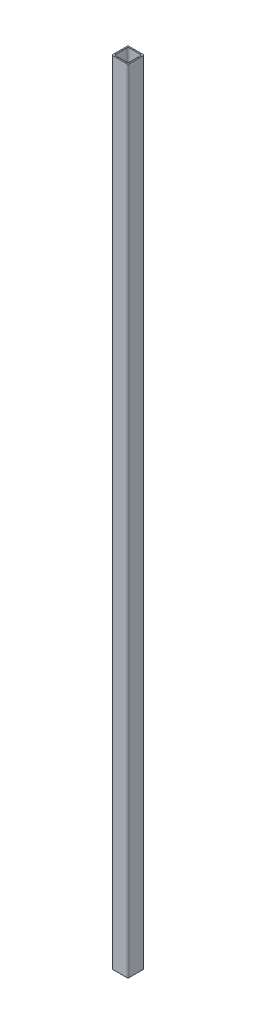
ISO-10303-21;
HEADER;
FILE_DESCRIPTION(('STEP AP214'),'2;1');
FILE_NAME('part.step','',(''),(''),'','','');
FILE_SCHEMA(('AUTOMOTIVE_DESIGN { 1 0 10303 214 1 1 1 1 }'));
ENDSEC;
DATA;
#1=APPLICATION_CONTEXT('core data for automotive mechanical design processes');
#2=APPLICATION_PROTOCOL_DEFINITION('international standard','automotive_design',2000,#1);
#3=PRODUCT_CONTEXT('',#1,'mechanical');
#4=PRODUCT('Part','Part','',(#3));
#5=PRODUCT_RELATED_PRODUCT_CATEGORY('part','',(#4));
#6=PRODUCT_DEFINITION_FORMATION('','',#4);
#7=PRODUCT_DEFINITION_CONTEXT('part definition',#1,'design');
#8=PRODUCT_DEFINITION('design','',#6,#7);
#9=PRODUCT_DEFINITION_SHAPE('','',#8);
#10=(LENGTH_UNIT() NAMED_UNIT(*) SI_UNIT(.MILLI.,.METRE.));
#11=(NAMED_UNIT(*) PLANE_ANGLE_UNIT() SI_UNIT($,.RADIAN.));
#12=(NAMED_UNIT(*) SI_UNIT($,.STERADIAN.) SOLID_ANGLE_UNIT());
#13=UNCERTAINTY_MEASURE_WITH_UNIT(LENGTH_MEASURE(1.E-05),#10,'distance_accuracy_value','');
#14=(GEOMETRIC_REPRESENTATION_CONTEXT(3) GLOBAL_UNCERTAINTY_ASSIGNED_CONTEXT((#13)) GLOBAL_UNIT_ASSIGNED_CONTEXT((#10,
#11,#12)) REPRESENTATION_CONTEXT('',''));
#15=CARTESIAN_POINT('',(0.,0.,0.));
#16=DIRECTION('',(0.,0.,1.));
#17=DIRECTION('',(1.,0.,0.));
#18=AXIS2_PLACEMENT_3D('',#15,#16,#17);
#19=CARTESIAN_POINT('',(-9.,1200.,9.));
#20=DIRECTION('',(0.,-1.,0.));
#21=DIRECTION('',(0.,0.,-1.));
#22=AXIS2_PLACEMENT_3D('',#19,#20,#21);
#23=CYLINDRICAL_SURFACE('',#22,0.999999999999999);
#24=CARTESIAN_POINT('',(-9.,220.,9.));
#25=DIRECTION('',(0.,-1.,0.));
#26=DIRECTION('',(0.,0.,-1.));
#27=AXIS2_PLACEMENT_3D('',#24,#25,#26);
#28=CIRCLE('',#27,0.999999999999999);
#29=CARTESIAN_POINT('',(-8.99999999999999,220.,10.));
#30=VERTEX_POINT('',#29);
#31=CARTESIAN_POINT('',(-10.,220.,8.99999999999999));
#32=VERTEX_POINT('',#31);
#33=EDGE_CURVE('E55',#30,#32,#28,.T.);
#34=ORIENTED_EDGE('',*,*,#33,.F.);
#35=DIRECTION('',(0.,-1.,0.));
#36=VECTOR('',#35,1.);
#37=CARTESIAN_POINT('',(-8.99999999999999,1200.,10.));
#38=LINE('',#37,#36);
#39=CARTESIAN_POINT('',(-8.99999999999999,1200.,10.));
#40=VERTEX_POINT('',#39);
#41=EDGE_CURVE('E48',#40,#30,#38,.T.);
#42=ORIENTED_EDGE('',*,*,#41,.F.);
#43=CARTESIAN_POINT('',(-9.,1200.,9.));
#44=DIRECTION('',(0.,1.,0.));
#45=DIRECTION('',(0.,0.,-1.));
#46=AXIS2_PLACEMENT_3D('',#43,#44,#45);
#47=CIRCLE('',#46,0.999999999999999);
#48=CARTESIAN_POINT('',(-10.,1200.,8.99999999999999));
#49=VERTEX_POINT('',#48);
#50=EDGE_CURVE('E203',#49,#40,#47,.T.);
#51=ORIENTED_EDGE('',*,*,#50,.F.);
#52=DIRECTION('',(0.,-1.,0.));
#53=VECTOR('',#52,1.);
#54=CARTESIAN_POINT('',(-10.,1200.,8.99999999999999));
#55=LINE('',#54,#53);
#56=EDGE_CURVE('E228',#49,#32,#55,.T.);
#57=ORIENTED_EDGE('',*,*,#56,.T.);
#58=EDGE_LOOP('',(#34,#42,#51,#57));
#59=FACE_BOUND('',#58,.T.);
#60=ADVANCED_FACE('F40',(#59),#23,.T.);
#61=CARTESIAN_POINT('',(-8.99999999999999,1200.,10.));
#62=DIRECTION('',(0.,0.,-1.));
#63=DIRECTION('',(-1.,0.,0.));
#64=AXIS2_PLACEMENT_3D('',#61,#62,#63);
#65=PLANE('',#64);
#66=DIRECTION('',(-1.,0.,0.));
#67=VECTOR('',#66,1.);
#68=CARTESIAN_POINT('',(-8.99999999999999,220.,10.));
#69=LINE('',#68,#67);
#70=CARTESIAN_POINT('',(8.99999999999999,220.,10.));
#71=VERTEX_POINT('',#70);
#72=EDGE_CURVE('E262',#71,#30,#69,.T.);
#73=ORIENTED_EDGE('',*,*,#72,.F.);
#74=DIRECTION('',(0.,-1.,0.));
#75=VECTOR('',#74,1.);
#76=CARTESIAN_POINT('',(8.99999999999999,1200.,10.));
#77=LINE('',#76,#75);
#78=CARTESIAN_POINT('',(8.99999999999999,1200.,10.));
#79=VERTEX_POINT('',#78);
#80=EDGE_CURVE('E252',#79,#71,#77,.T.);
#81=ORIENTED_EDGE('',*,*,#80,.F.);
#82=DIRECTION('',(1.,0.,0.));
#83=VECTOR('',#82,1.);
#84=CARTESIAN_POINT('',(-8.99999999999999,1200.,10.));
#85=LINE('',#84,#83);
#86=EDGE_CURVE('E207',#40,#79,#85,.T.);
#87=ORIENTED_EDGE('',*,*,#86,.F.);
#88=ORIENTED_EDGE('',*,*,#41,.T.);
#89=EDGE_LOOP('',(#73,#81,#87,#88));
#90=FACE_BOUND('',#89,.T.);
#91=ADVANCED_FACE('F260',(#90),#65,.F.);
#92=CARTESIAN_POINT('',(9.,1200.,9.));
#93=DIRECTION('',(0.,-1.,0.));
#94=DIRECTION('',(0.,0.,-1.));
#95=AXIS2_PLACEMENT_3D('',#92,#93,#94);
#96=CYLINDRICAL_SURFACE('',#95,0.999999999999999);
#97=CARTESIAN_POINT('',(9.,220.,9.));
#98=DIRECTION('',(0.,-1.,0.));
#99=DIRECTION('',(0.,0.,-1.));
#100=AXIS2_PLACEMENT_3D('',#97,#98,#99);
#101=CIRCLE('',#100,0.999999999999999);
#102=CARTESIAN_POINT('',(10.,220.,8.99999999999999));
#103=VERTEX_POINT('',#102);
#104=EDGE_CURVE('E273',#103,#71,#101,.T.);
#105=ORIENTED_EDGE('',*,*,#104,.F.);
#106=DIRECTION('',(0.,-1.,0.));
#107=VECTOR('',#106,1.);
#108=CARTESIAN_POINT('',(10.,1200.,8.99999999999999));
#109=LINE('',#108,#107);
#110=CARTESIAN_POINT('',(10.,1200.,8.99999999999999));
#111=VERTEX_POINT('',#110);
#112=EDGE_CURVE('E248',#111,#103,#109,.T.);
#113=ORIENTED_EDGE('',*,*,#112,.F.);
#114=CARTESIAN_POINT('',(9.,1200.,9.));
#115=DIRECTION('',(0.,1.,0.));
#116=DIRECTION('',(0.,0.,1.));
#117=AXIS2_PLACEMENT_3D('',#114,#115,#116);
#118=CIRCLE('',#117,0.999999999999999);
#119=EDGE_CURVE('E210',#79,#111,#118,.T.);
#120=ORIENTED_EDGE('',*,*,#119,.F.);
#121=ORIENTED_EDGE('',*,*,#80,.T.);
#122=EDGE_LOOP('',(#105,#113,#120,#121));
#123=FACE_BOUND('',#122,.T.);
#124=ADVANCED_FACE('F331',(#123),#96,.T.);
#125=CARTESIAN_POINT('',(10.,1200.,8.99999999999999));
#126=DIRECTION('',(-1.,0.,0.));
#127=DIRECTION('',(0.,0.,1.));
#128=AXIS2_PLACEMENT_3D('',#125,#126,#127);
#129=PLANE('',#128);
#130=DIRECTION('',(0.,0.,1.));
#131=VECTOR('',#130,1.);
#132=CARTESIAN_POINT('',(10.,220.,8.99999999999999));
#133=LINE('',#132,#131);
#134=CARTESIAN_POINT('',(10.,220.,-8.99999999999999));
#135=VERTEX_POINT('',#134);
#136=EDGE_CURVE('E324',#135,#103,#133,.T.);
#137=ORIENTED_EDGE('',*,*,#136,.F.);
#138=DIRECTION('',(0.,-1.,0.));
#139=VECTOR('',#138,1.);
#140=CARTESIAN_POINT('',(10.,1200.,-8.99999999999999));
#141=LINE('',#140,#139);
#142=CARTESIAN_POINT('',(10.,1200.,-8.99999999999999));
#143=VERTEX_POINT('',#142);
#144=EDGE_CURVE('E244',#143,#135,#141,.T.);
#145=ORIENTED_EDGE('',*,*,#144,.F.);
#146=DIRECTION('',(0.,0.,-1.));
#147=VECTOR('',#146,1.);
#148=CARTESIAN_POINT('',(10.,1200.,8.99999999999999));
#149=LINE('',#148,#147);
#150=EDGE_CURVE('E213',#111,#143,#149,.T.);
#151=ORIENTED_EDGE('',*,*,#150,.F.);
#152=ORIENTED_EDGE('',*,*,#112,.T.);
#153=EDGE_LOOP('',(#137,#145,#151,#152));
#154=FACE_BOUND('',#153,.T.);
#155=ADVANCED_FACE('F335',(#154),#129,.F.);
#156=CARTESIAN_POINT('',(9.,1200.,-9.));
#157=DIRECTION('',(0.,-1.,0.));
#158=DIRECTION('',(0.,0.,-1.));
#159=AXIS2_PLACEMENT_3D('',#156,#157,#158);
#160=CYLINDRICAL_SURFACE('',#159,0.999999999999999);
#161=CARTESIAN_POINT('',(9.,220.,-9.));
#162=DIRECTION('',(0.,-1.,0.));
#163=DIRECTION('',(0.,0.,-1.));
#164=AXIS2_PLACEMENT_3D('',#161,#162,#163);
#165=CIRCLE('',#164,0.999999999999999);
#166=CARTESIAN_POINT('',(8.99999999999999,220.,-10.));
#167=VERTEX_POINT('',#166);
#168=EDGE_CURVE('E321',#167,#135,#165,.T.);
#169=ORIENTED_EDGE('',*,*,#168,.F.);
#170=DIRECTION('',(0.,-1.,0.));
#171=VECTOR('',#170,1.);
#172=CARTESIAN_POINT('',(8.99999999999999,1200.,-10.));
#173=LINE('',#172,#171);
#174=CARTESIAN_POINT('',(8.99999999999999,1200.,-10.));
#175=VERTEX_POINT('',#174);
#176=EDGE_CURVE('E240',#175,#167,#173,.T.);
#177=ORIENTED_EDGE('',*,*,#176,.F.);
#178=CARTESIAN_POINT('',(9.,1200.,-9.));
#179=DIRECTION('',(0.,1.,0.));
#180=DIRECTION('',(0.,0.,-1.));
#181=AXIS2_PLACEMENT_3D('',#178,#179,#180);
#182=CIRCLE('',#181,0.999999999999999);
#183=EDGE_CURVE('E216',#143,#175,#182,.T.);
#184=ORIENTED_EDGE('',*,*,#183,.F.);
#185=ORIENTED_EDGE('',*,*,#144,.T.);
#186=EDGE_LOOP('',(#169,#177,#184,#185));
#187=FACE_BOUND('',#186,.T.);
#188=ADVANCED_FACE('F355',(#187),#160,.T.);
#189=CARTESIAN_POINT('',(-8.99999999999999,1200.,-10.));
#190=DIRECTION('',(0.,0.,1.));
#191=DIRECTION('',(1.,0.,0.));
#192=AXIS2_PLACEMENT_3D('',#189,#190,#191);
#193=PLANE('',#192);
#194=DIRECTION('',(1.,0.,0.));
#195=VECTOR('',#194,1.);
#196=CARTESIAN_POINT('',(-8.99999999999999,220.,-10.));
#197=LINE('',#196,#195);
#198=CARTESIAN_POINT('',(-9.,220.,-10.));
#199=VERTEX_POINT('',#198);
#200=EDGE_CURVE('E318',#199,#167,#197,.T.);
#201=ORIENTED_EDGE('',*,*,#200,.F.);
#202=DIRECTION('',(0.,-1.,0.));
#203=VECTOR('',#202,1.);
#204=CARTESIAN_POINT('',(-8.99999999999999,1200.,-10.));
#205=LINE('',#204,#203);
#206=CARTESIAN_POINT('',(-8.99999999999999,1200.,-10.));
#207=VERTEX_POINT('',#206);
#208=EDGE_CURVE('E236',#207,#199,#205,.T.);
#209=ORIENTED_EDGE('',*,*,#208,.F.);
#210=DIRECTION('',(-1.,0.,0.));
#211=VECTOR('',#210,1.);
#212=CARTESIAN_POINT('',(-8.99999999999999,1200.,-10.));
#213=LINE('',#212,#211);
#214=EDGE_CURVE('E219',#175,#207,#213,.T.);
#215=ORIENTED_EDGE('',*,*,#214,.F.);
#216=ORIENTED_EDGE('',*,*,#176,.T.);
#217=EDGE_LOOP('',(#201,#209,#215,#216));
#218=FACE_BOUND('',#217,.T.);
#219=ADVANCED_FACE('F352',(#218),#193,.F.);
#220=CARTESIAN_POINT('',(-9.,1200.,-9.));
#221=DIRECTION('',(0.,-1.,0.));
#222=DIRECTION('',(0.,0.,-1.));
#223=AXIS2_PLACEMENT_3D('',#220,#221,#222);
#224=CYLINDRICAL_SURFACE('',#223,0.999999999999999);
#225=CARTESIAN_POINT('',(-9.,220.,-9.));
#226=DIRECTION('',(0.,-1.,0.));
#227=DIRECTION('',(0.,0.,-1.));
#228=AXIS2_PLACEMENT_3D('',#225,#226,#227);
#229=CIRCLE('',#228,0.999999999999999);
#230=CARTESIAN_POINT('',(-10.,220.,-8.99999999999999));
#231=VERTEX_POINT('',#230);
#232=EDGE_CURVE('E315',#231,#199,#229,.T.);
#233=ORIENTED_EDGE('',*,*,#232,.F.);
#234=DIRECTION('',(0.,-1.,0.));
#235=VECTOR('',#234,1.);
#236=CARTESIAN_POINT('',(-10.,1200.,-8.99999999999999));
#237=LINE('',#236,#235);
#238=CARTESIAN_POINT('',(-10.,1200.,-8.99999999999999));
#239=VERTEX_POINT('',#238);
#240=EDGE_CURVE('E232',#239,#231,#237,.T.);
#241=ORIENTED_EDGE('',*,*,#240,.F.);
#242=CARTESIAN_POINT('',(-9.,1200.,-9.));
#243=DIRECTION('',(0.,1.,0.));
#244=DIRECTION('',(0.,0.,-1.));
#245=AXIS2_PLACEMENT_3D('',#242,#243,#244);
#246=CIRCLE('',#245,0.999999999999999);
#247=EDGE_CURVE('E222',#207,#239,#246,.T.);
#248=ORIENTED_EDGE('',*,*,#247,.F.);
#249=ORIENTED_EDGE('',*,*,#208,.T.);
#250=EDGE_LOOP('',(#233,#241,#248,#249));
#251=FACE_BOUND('',#250,.T.);
#252=ADVANCED_FACE('F348',(#251),#224,.T.);
#253=CARTESIAN_POINT('',(-10.,1200.,8.99999999999999));
#254=DIRECTION('',(1.,0.,0.));
#255=DIRECTION('',(0.,0.,-1.));
#256=AXIS2_PLACEMENT_3D('',#253,#254,#255);
#257=PLANE('',#256);
#258=DIRECTION('',(0.,0.,-1.));
#259=VECTOR('',#258,1.);
#260=CARTESIAN_POINT('',(-10.,220.,8.99999999999999));
#261=LINE('',#260,#259);
#262=EDGE_CURVE('E165',#32,#231,#261,.T.);
#263=ORIENTED_EDGE('',*,*,#262,.F.);
#264=ORIENTED_EDGE('',*,*,#56,.F.);
#265=DIRECTION('',(0.,0.,1.));
#266=VECTOR('',#265,1.);
#267=CARTESIAN_POINT('',(-10.,1200.,8.99999999999999));
#268=LINE('',#267,#266);
#269=EDGE_CURVE('E225',#239,#49,#268,.T.);
#270=ORIENTED_EDGE('',*,*,#269,.F.);
#271=ORIENTED_EDGE('',*,*,#240,.T.);
#272=EDGE_LOOP('',(#263,#264,#270,#271));
#273=FACE_BOUND('',#272,.T.);
#274=ADVANCED_FACE('F344',(#273),#257,.F.);
#275=CARTESIAN_POINT('',(-7.5,1200.,7.5));
#276=DIRECTION('',(0.,-1.,0.));
#277=DIRECTION('',(0.,0.,-1.));
#278=AXIS2_PLACEMENT_3D('',#275,#276,#277);
#279=CYLINDRICAL_SURFACE('',#278,1.);
#280=DIRECTION('',(0.,-1.,0.));
#281=VECTOR('',#280,1.);
#282=CARTESIAN_POINT('',(-7.5,1200.,8.5));
#283=LINE('',#282,#281);
#284=CARTESIAN_POINT('',(-7.5,1200.,8.5));
#285=VERTEX_POINT('',#284);
#286=CARTESIAN_POINT('',(-7.5,220.,8.5));
#287=VERTEX_POINT('',#286);
#288=EDGE_CURVE('E163',#285,#287,#283,.T.);
#289=ORIENTED_EDGE('',*,*,#288,.T.);
#290=CARTESIAN_POINT('',(-7.5,220.,7.5));
#291=DIRECTION('',(0.,-1.,0.));
#292=DIRECTION('',(0.,0.,-1.));
#293=AXIS2_PLACEMENT_3D('',#290,#291,#292);
#294=CIRCLE('',#293,1.);
#295=CARTESIAN_POINT('',(-8.5,220.,7.49999999999999));
#296=VERTEX_POINT('',#295);
#297=EDGE_CURVE('E151',#287,#296,#294,.T.);
#298=ORIENTED_EDGE('',*,*,#297,.T.);
#299=DIRECTION('',(0.,-1.,0.));
#300=VECTOR('',#299,1.);
#301=CARTESIAN_POINT('',(-8.5,1200.,7.49999999999999));
#302=LINE('',#301,#300);
#303=CARTESIAN_POINT('',(-8.5,1200.,7.49999999999999));
#304=VERTEX_POINT('',#303);
#305=EDGE_CURVE('E160',#304,#296,#302,.T.);
#306=ORIENTED_EDGE('',*,*,#305,.F.);
#307=CARTESIAN_POINT('',(-7.5,1200.,7.5));
#308=DIRECTION('',(0.,1.,0.));
#309=DIRECTION('',(0.,0.,-1.));
#310=AXIS2_PLACEMENT_3D('',#307,#308,#309);
#311=CIRCLE('',#310,1.);
#312=EDGE_CURVE('E267',#304,#285,#311,.T.);
#313=ORIENTED_EDGE('',*,*,#312,.T.);
#314=EDGE_LOOP('',(#289,#298,#306,#313));
#315=FACE_BOUND('',#314,.T.);
#316=ADVANCED_FACE('F159',(#315),#279,.F.);
#317=CARTESIAN_POINT('',(-7.5,1200.,8.5));
#318=DIRECTION('',(0.,0.,-1.));
#319=DIRECTION('',(-1.,0.,0.));
#320=AXIS2_PLACEMENT_3D('',#317,#318,#319);
#321=PLANE('',#320);
#322=DIRECTION('',(0.,-1.,0.));
#323=VECTOR('',#322,1.);
#324=CARTESIAN_POINT('',(7.49999999999999,1200.,8.5));
#325=LINE('',#324,#323);
#326=CARTESIAN_POINT('',(7.49999999999999,1200.,8.5));
#327=VERTEX_POINT('',#326);
#328=CARTESIAN_POINT('',(7.49999999999999,220.,8.5));
#329=VERTEX_POINT('',#328);
#330=EDGE_CURVE('E197',#327,#329,#325,.T.);
#331=ORIENTED_EDGE('',*,*,#330,.T.);
#332=DIRECTION('',(-1.,0.,0.));
#333=VECTOR('',#332,1.);
#334=CARTESIAN_POINT('',(-7.5,220.,8.5));
#335=LINE('',#334,#333);
#336=EDGE_CURVE('E166',#329,#287,#335,.T.);
#337=ORIENTED_EDGE('',*,*,#336,.T.);
#338=ORIENTED_EDGE('',*,*,#288,.F.);
#339=DIRECTION('',(1.,0.,0.));
#340=VECTOR('',#339,1.);
#341=CARTESIAN_POINT('',(-7.5,1200.,8.5));
#342=LINE('',#341,#340);
#343=EDGE_CURVE('E271',#285,#327,#342,.T.);
#344=ORIENTED_EDGE('',*,*,#343,.T.);
#345=EDGE_LOOP('',(#331,#337,#338,#344));
#346=FACE_BOUND('',#345,.T.);
#347=ADVANCED_FACE('F302',(#346),#321,.T.);
#348=CARTESIAN_POINT('',(7.5,1200.,7.5));
#349=DIRECTION('',(0.,-1.,0.));
#350=DIRECTION('',(0.,0.,-1.));
#351=AXIS2_PLACEMENT_3D('',#348,#349,#350);
#352=CYLINDRICAL_SURFACE('',#351,1.);
#353=DIRECTION('',(0.,-1.,0.));
#354=VECTOR('',#353,1.);
#355=CARTESIAN_POINT('',(8.5,1200.,7.49999999999999));
#356=LINE('',#355,#354);
#357=CARTESIAN_POINT('',(8.5,1200.,7.49999999999999));
#358=VERTEX_POINT('',#357);
#359=CARTESIAN_POINT('',(8.5,220.,7.49999999999999));
#360=VERTEX_POINT('',#359);
#361=EDGE_CURVE('E193',#358,#360,#356,.T.);
#362=ORIENTED_EDGE('',*,*,#361,.T.);
#363=CARTESIAN_POINT('',(7.5,220.,7.5));
#364=DIRECTION('',(0.,-1.,0.));
#365=DIRECTION('',(0.,0.,-1.));
#366=AXIS2_PLACEMENT_3D('',#363,#364,#365);
#367=CIRCLE('',#366,1.);
#368=EDGE_CURVE('E306',#360,#329,#367,.T.);
#369=ORIENTED_EDGE('',*,*,#368,.T.);
#370=ORIENTED_EDGE('',*,*,#330,.F.);
#371=CARTESIAN_POINT('',(7.5,1200.,7.5));
#372=DIRECTION('',(0.,1.,0.));
#373=DIRECTION('',(0.,0.,1.));
#374=AXIS2_PLACEMENT_3D('',#371,#372,#373);
#375=CIRCLE('',#374,1.);
#376=EDGE_CURVE('E279',#327,#358,#375,.T.);
#377=ORIENTED_EDGE('',*,*,#376,.T.);
#378=EDGE_LOOP('',(#362,#369,#370,#377));
#379=FACE_BOUND('',#378,.T.);
#380=ADVANCED_FACE('F424',(#379),#352,.F.);
#381=CARTESIAN_POINT('',(8.5,1200.,7.49999999999999));
#382=DIRECTION('',(-1.,0.,0.));
#383=DIRECTION('',(0.,0.,1.));
#384=AXIS2_PLACEMENT_3D('',#381,#382,#383);
#385=PLANE('',#384);
#386=DIRECTION('',(0.,-1.,0.));
#387=VECTOR('',#386,1.);
#388=CARTESIAN_POINT('',(8.5,1200.,-7.49999999999999));
#389=LINE('',#388,#387);
#390=CARTESIAN_POINT('',(8.5,1200.,-7.49999999999999));
#391=VERTEX_POINT('',#390);
#392=CARTESIAN_POINT('',(8.5,220.,-7.49999999999999));
#393=VERTEX_POINT('',#392);
#394=EDGE_CURVE('E189',#391,#393,#389,.T.);
#395=ORIENTED_EDGE('',*,*,#394,.T.);
#396=DIRECTION('',(0.,0.,1.));
#397=VECTOR('',#396,1.);
#398=CARTESIAN_POINT('',(8.5,220.,7.49999999999999));
#399=LINE('',#398,#397);
#400=EDGE_CURVE('E309',#393,#360,#399,.T.);
#401=ORIENTED_EDGE('',*,*,#400,.T.);
#402=ORIENTED_EDGE('',*,*,#361,.F.);
#403=DIRECTION('',(0.,0.,-1.));
#404=VECTOR('',#403,1.);
#405=CARTESIAN_POINT('',(8.5,1200.,7.49999999999999));
#406=LINE('',#405,#404);
#407=EDGE_CURVE('E282',#358,#391,#406,.T.);
#408=ORIENTED_EDGE('',*,*,#407,.T.);
#409=EDGE_LOOP('',(#395,#401,#402,#408));
#410=FACE_BOUND('',#409,.T.);
#411=ADVANCED_FACE('F433',(#410),#385,.T.);
#412=CARTESIAN_POINT('',(7.5,1200.,-7.5));
#413=DIRECTION('',(0.,-1.,0.));
#414=DIRECTION('',(0.,0.,-1.));
#415=AXIS2_PLACEMENT_3D('',#412,#413,#414);
#416=CYLINDRICAL_SURFACE('',#415,1.);
#417=DIRECTION('',(0.,-1.,0.));
#418=VECTOR('',#417,1.);
#419=CARTESIAN_POINT('',(7.49999999999999,1200.,-8.5));
#420=LINE('',#419,#418);
#421=CARTESIAN_POINT('',(7.49999999999999,1200.,-8.5));
#422=VERTEX_POINT('',#421);
#423=CARTESIAN_POINT('',(7.49999999999999,220.,-8.5));
#424=VERTEX_POINT('',#423);
#425=EDGE_CURVE('E185',#422,#424,#420,.T.);
#426=ORIENTED_EDGE('',*,*,#425,.T.);
#427=CARTESIAN_POINT('',(7.5,220.,-7.5));
#428=DIRECTION('',(0.,-1.,0.));
#429=DIRECTION('',(0.,0.,-1.));
#430=AXIS2_PLACEMENT_3D('',#427,#428,#429);
#431=CIRCLE('',#430,1.);
#432=EDGE_CURVE('E513',#424,#393,#431,.T.);
#433=ORIENTED_EDGE('',*,*,#432,.T.);
#434=ORIENTED_EDGE('',*,*,#394,.F.);
#435=CARTESIAN_POINT('',(7.5,1200.,-7.5));
#436=DIRECTION('',(0.,1.,0.));
#437=DIRECTION('',(0.,0.,-1.));
#438=AXIS2_PLACEMENT_3D('',#435,#436,#437);
#439=CIRCLE('',#438,1.);
#440=EDGE_CURVE('E285',#391,#422,#439,.T.);
#441=ORIENTED_EDGE('',*,*,#440,.T.);
#442=EDGE_LOOP('',(#426,#433,#434,#441));
#443=FACE_BOUND('',#442,.T.);
#444=ADVANCED_FACE('F443',(#443),#416,.F.);
#445=CARTESIAN_POINT('',(-7.5,1200.,-8.5));
#446=DIRECTION('',(0.,0.,1.));
#447=DIRECTION('',(1.,0.,0.));
#448=AXIS2_PLACEMENT_3D('',#445,#446,#447);
#449=PLANE('',#448);
#450=DIRECTION('',(0.,-1.,0.));
#451=VECTOR('',#450,1.);
#452=CARTESIAN_POINT('',(-7.5,1200.,-8.5));
#453=LINE('',#452,#451);
#454=CARTESIAN_POINT('',(-7.5,1200.,-8.5));
#455=VERTEX_POINT('',#454);
#456=CARTESIAN_POINT('',(-7.5,220.,-8.5));
#457=VERTEX_POINT('',#456);
#458=EDGE_CURVE('E176',#455,#457,#453,.T.);
#459=ORIENTED_EDGE('',*,*,#458,.T.);
#460=DIRECTION('',(1.,0.,0.));
#461=VECTOR('',#460,1.);
#462=CARTESIAN_POINT('',(-7.5,220.,-8.5));
#463=LINE('',#462,#461);
#464=EDGE_CURVE('E508',#457,#424,#463,.T.);
#465=ORIENTED_EDGE('',*,*,#464,.T.);
#466=ORIENTED_EDGE('',*,*,#425,.F.);
#467=DIRECTION('',(-1.,0.,0.));
#468=VECTOR('',#467,1.);
#469=CARTESIAN_POINT('',(-7.5,1200.,-8.5));
#470=LINE('',#469,#468);
#471=EDGE_CURVE('E288',#422,#455,#470,.T.);
#472=ORIENTED_EDGE('',*,*,#471,.T.);
#473=EDGE_LOOP('',(#459,#465,#466,#472));
#474=FACE_BOUND('',#473,.T.);
#475=ADVANCED_FACE('F453',(#474),#449,.T.);
#476=CARTESIAN_POINT('',(-7.5,1200.,-7.5));
#477=DIRECTION('',(0.,-1.,0.));
#478=DIRECTION('',(0.,0.,-1.));
#479=AXIS2_PLACEMENT_3D('',#476,#477,#478);
#480=CYLINDRICAL_SURFACE('',#479,1.);
#481=DIRECTION('',(0.,-1.,0.));
#482=VECTOR('',#481,1.);
#483=CARTESIAN_POINT('',(-8.5,1200.,-7.49999999999999));
#484=LINE('',#483,#482);
#485=CARTESIAN_POINT('',(-8.5,1200.,-7.49999999999999));
#486=VERTEX_POINT('',#485);
#487=CARTESIAN_POINT('',(-8.5,220.,-7.49999999999999));
#488=VERTEX_POINT('',#487);
#489=EDGE_CURVE('E172',#486,#488,#484,.T.);
#490=ORIENTED_EDGE('',*,*,#489,.T.);
#491=CARTESIAN_POINT('',(-7.5,220.,-7.5));
#492=DIRECTION('',(0.,-1.,0.));
#493=DIRECTION('',(0.,0.,-1.));
#494=AXIS2_PLACEMENT_3D('',#491,#492,#493);
#495=CIRCLE('',#494,1.);
#496=EDGE_CURVE('E63',#488,#457,#495,.T.);
#497=ORIENTED_EDGE('',*,*,#496,.T.);
#498=ORIENTED_EDGE('',*,*,#458,.F.);
#499=CARTESIAN_POINT('',(-7.5,1200.,-7.5));
#500=DIRECTION('',(0.,1.,0.));
#501=DIRECTION('',(0.,0.,-1.));
#502=AXIS2_PLACEMENT_3D('',#499,#500,#501);
#503=CIRCLE('',#502,1.);
#504=EDGE_CURVE('E178',#455,#486,#503,.T.);
#505=ORIENTED_EDGE('',*,*,#504,.T.);
#506=EDGE_LOOP('',(#490,#497,#498,#505));
#507=FACE_BOUND('',#506,.T.);
#508=ADVANCED_FACE('F295',(#507),#480,.F.);
#509=CARTESIAN_POINT('',(-8.5,1200.,7.49999999999999));
#510=DIRECTION('',(1.,0.,0.));
#511=DIRECTION('',(0.,0.,-1.));
#512=AXIS2_PLACEMENT_3D('',#509,#510,#511);
#513=PLANE('',#512);
#514=ORIENTED_EDGE('',*,*,#305,.T.);
#515=DIRECTION('',(0.,0.,-1.));
#516=VECTOR('',#515,1.);
#517=CARTESIAN_POINT('',(-8.5,220.,7.49999999999999));
#518=LINE('',#517,#516);
#519=EDGE_CURVE('E11',#296,#488,#518,.T.);
#520=ORIENTED_EDGE('',*,*,#519,.T.);
#521=ORIENTED_EDGE('',*,*,#489,.F.);
#522=DIRECTION('',(0.,0.,1.));
#523=VECTOR('',#522,1.);
#524=CARTESIAN_POINT('',(-8.5,1200.,7.49999999999999));
#525=LINE('',#524,#523);
#526=EDGE_CURVE('E170',#486,#304,#525,.T.);
#527=ORIENTED_EDGE('',*,*,#526,.T.);
#528=EDGE_LOOP('',(#514,#520,#521,#527));
#529=FACE_BOUND('',#528,.T.);
#530=ADVANCED_FACE('F168',(#529),#513,.T.);
#531=CARTESIAN_POINT('',(-9.,1200.,9.));
#532=DIRECTION('',(0.,-1.,0.));
#533=DIRECTION('',(0.,0.,-1.));
#534=AXIS2_PLACEMENT_3D('',#531,#532,#533);
#535=PLANE('',#534);
#536=ORIENTED_EDGE('',*,*,#50,.T.);
#537=ORIENTED_EDGE('',*,*,#86,.T.);
#538=ORIENTED_EDGE('',*,*,#119,.T.);
#539=ORIENTED_EDGE('',*,*,#150,.T.);
#540=ORIENTED_EDGE('',*,*,#183,.T.);
#541=ORIENTED_EDGE('',*,*,#214,.T.);
#542=ORIENTED_EDGE('',*,*,#247,.T.);
#543=ORIENTED_EDGE('',*,*,#269,.T.);
#544=EDGE_LOOP('',(#536,#537,#538,#539,#540,#541,#542,#543));
#545=FACE_BOUND('',#544,.T.);
#546=ORIENTED_EDGE('',*,*,#312,.F.);
#547=ORIENTED_EDGE('',*,*,#526,.F.);
#548=ORIENTED_EDGE('',*,*,#504,.F.);
#549=ORIENTED_EDGE('',*,*,#471,.F.);
#550=ORIENTED_EDGE('',*,*,#440,.F.);
#551=ORIENTED_EDGE('',*,*,#407,.F.);
#552=ORIENTED_EDGE('',*,*,#376,.F.);
#553=ORIENTED_EDGE('',*,*,#343,.F.);
#554=EDGE_LOOP('',(#546,#547,#548,#549,#550,#551,#552,#553));
#555=FACE_BOUND('',#554,.T.);
#556=ADVANCED_FACE('F298',(#545,#555),#535,.F.);
#557=CARTESIAN_POINT('',(0.,220.,0.));
#558=DIRECTION('',(0.,-1.,0.));
#559=DIRECTION('',(0.,0.,-1.));
#560=AXIS2_PLACEMENT_3D('',#557,#558,#559);
#561=PLANE('',#560);
#562=ORIENTED_EDGE('',*,*,#336,.F.);
#563=ORIENTED_EDGE('',*,*,#368,.F.);
#564=ORIENTED_EDGE('',*,*,#400,.F.);
#565=ORIENTED_EDGE('',*,*,#432,.F.);
#566=ORIENTED_EDGE('',*,*,#464,.F.);
#567=ORIENTED_EDGE('',*,*,#496,.F.);
#568=ORIENTED_EDGE('',*,*,#519,.F.);
#569=ORIENTED_EDGE('',*,*,#297,.F.);
#570=EDGE_LOOP('',(#562,#563,#564,#565,#566,#567,#568,#569));
#571=FACE_BOUND('',#570,.T.);
#572=ORIENTED_EDGE('',*,*,#33,.T.);
#573=ORIENTED_EDGE('',*,*,#262,.T.);
#574=ORIENTED_EDGE('',*,*,#232,.T.);
#575=ORIENTED_EDGE('',*,*,#200,.T.);
#576=ORIENTED_EDGE('',*,*,#168,.T.);
#577=ORIENTED_EDGE('',*,*,#136,.T.);
#578=ORIENTED_EDGE('',*,*,#104,.T.);
#579=ORIENTED_EDGE('',*,*,#72,.T.);
#580=EDGE_LOOP('',(#572,#573,#574,#575,#576,#577,#578,#579));
#581=FACE_BOUND('',#580,.T.);
#582=ADVANCED_FACE('F150',(#571,#581),#561,.T.);
#583=CLOSED_SHELL('',(#60,#91,#124,#155,#188,#219,#252,#274,#316,#347,#380,#411,#444,#475,#508,
#530,#556,#582));
#584=MANIFOLD_SOLID_BREP('B2',#583);
#585=ADVANCED_BREP_SHAPE_REPRESENTATION('',(#18,#584),#14);
#586=SHAPE_DEFINITION_REPRESENTATION(#9,#585);
ENDSEC;
END-ISO-10303-21;
